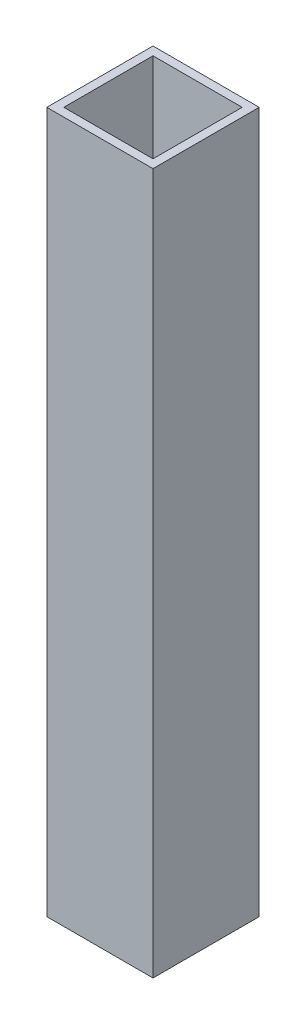
ISO-10303-21;
HEADER;
FILE_DESCRIPTION(('STEP AP214'),'2;1');
FILE_NAME('part.step','',(''),(''),'','','');
FILE_SCHEMA(('AUTOMOTIVE_DESIGN { 1 0 10303 214 1 1 1 1 }'));
ENDSEC;
DATA;
#1=APPLICATION_CONTEXT('core data for automotive mechanical design processes');
#2=APPLICATION_PROTOCOL_DEFINITION('international standard','automotive_design',2000,#1);
#3=PRODUCT_CONTEXT('',#1,'mechanical');
#4=PRODUCT('Part','Part','',(#3));
#5=PRODUCT_RELATED_PRODUCT_CATEGORY('part','',(#4));
#6=PRODUCT_DEFINITION_FORMATION('','',#4);
#7=PRODUCT_DEFINITION_CONTEXT('part definition',#1,'design');
#8=PRODUCT_DEFINITION('design','',#6,#7);
#9=PRODUCT_DEFINITION_SHAPE('','',#8);
#10=(LENGTH_UNIT() NAMED_UNIT(*) SI_UNIT(.MILLI.,.METRE.));
#11=(NAMED_UNIT(*) PLANE_ANGLE_UNIT() SI_UNIT($,.RADIAN.));
#12=(NAMED_UNIT(*) SI_UNIT($,.STERADIAN.) SOLID_ANGLE_UNIT());
#13=UNCERTAINTY_MEASURE_WITH_UNIT(LENGTH_MEASURE(1.E-05),#10,'distance_accuracy_value','');
#14=(GEOMETRIC_REPRESENTATION_CONTEXT(3) GLOBAL_UNCERTAINTY_ASSIGNED_CONTEXT((#13)) GLOBAL_UNIT_ASSIGNED_CONTEXT((#10,
#11,#12)) REPRESENTATION_CONTEXT('',''));
#15=CARTESIAN_POINT('',(0.,0.,0.));
#16=DIRECTION('',(0.,0.,1.));
#17=DIRECTION('',(1.,0.,0.));
#18=AXIS2_PLACEMENT_3D('',#15,#16,#17);
#19=CARTESIAN_POINT('',(0.,165.,0.));
#20=DIRECTION('',(0.,1.,0.));
#21=DIRECTION('',(0.,0.,1.));
#22=AXIS2_PLACEMENT_3D('',#19,#20,#21);
#23=PLANE('',#22);
#24=DIRECTION('',(0.,0.,1.));
#25=VECTOR('',#24,1.);
#26=CARTESIAN_POINT('',(-12.5,165.,-12.5));
#27=LINE('',#26,#25);
#28=CARTESIAN_POINT('',(-12.5,165.,-12.5));
#29=VERTEX_POINT('',#28);
#30=CARTESIAN_POINT('',(-12.5,165.,12.5));
#31=VERTEX_POINT('',#30);
#32=EDGE_CURVE('E134',#29,#31,#27,.T.);
#33=ORIENTED_EDGE('',*,*,#32,.T.);
#34=DIRECTION('',(1.,0.,0.));
#35=VECTOR('',#34,1.);
#36=CARTESIAN_POINT('',(-12.5,165.,12.5));
#37=LINE('',#36,#35);
#38=CARTESIAN_POINT('',(12.5,165.,12.5));
#39=VERTEX_POINT('',#38);
#40=EDGE_CURVE('E137',#31,#39,#37,.T.);
#41=ORIENTED_EDGE('',*,*,#40,.T.);
#42=DIRECTION('',(0.,0.,-1.));
#43=VECTOR('',#42,1.);
#44=CARTESIAN_POINT('',(12.5,165.,-12.5));
#45=LINE('',#44,#43);
#46=CARTESIAN_POINT('',(12.5,165.,-12.5));
#47=VERTEX_POINT('',#46);
#48=EDGE_CURVE('E140',#39,#47,#45,.T.);
#49=ORIENTED_EDGE('',*,*,#48,.T.);
#50=DIRECTION('',(-1.,0.,0.));
#51=VECTOR('',#50,1.);
#52=CARTESIAN_POINT('',(-12.5,165.,-12.5));
#53=LINE('',#52,#51);
#54=EDGE_CURVE('E142',#47,#29,#53,.T.);
#55=ORIENTED_EDGE('',*,*,#54,.T.);
#56=EDGE_LOOP('',(#33,#41,#49,#55));
#57=FACE_BOUND('',#56,.T.);
#58=DIRECTION('',(1.,0.,0.));
#59=VECTOR('',#58,1.);
#60=CARTESIAN_POINT('',(-10.5,165.,10.5));
#61=LINE('',#60,#59);
#62=CARTESIAN_POINT('',(-10.5,165.,10.5));
#63=VERTEX_POINT('',#62);
#64=CARTESIAN_POINT('',(10.5,165.,10.5));
#65=VERTEX_POINT('',#64);
#66=EDGE_CURVE('E106',#63,#65,#61,.T.);
#67=ORIENTED_EDGE('',*,*,#66,.F.);
#68=DIRECTION('',(0.,0.,1.));
#69=VECTOR('',#68,1.);
#70=CARTESIAN_POINT('',(-10.5,165.,-10.5));
#71=LINE('',#70,#69);
#72=CARTESIAN_POINT('',(-10.5,165.,-10.5));
#73=VERTEX_POINT('',#72);
#74=EDGE_CURVE('E98',#73,#63,#71,.T.);
#75=ORIENTED_EDGE('',*,*,#74,.F.);
#76=DIRECTION('',(-1.,0.,0.));
#77=VECTOR('',#76,1.);
#78=CARTESIAN_POINT('',(-10.5,165.,-10.5));
#79=LINE('',#78,#77);
#80=CARTESIAN_POINT('',(10.5,165.,-10.5));
#81=VERTEX_POINT('',#80);
#82=EDGE_CURVE('E120',#81,#73,#79,.T.);
#83=ORIENTED_EDGE('',*,*,#82,.F.);
#84=DIRECTION('',(0.,0.,-1.));
#85=VECTOR('',#84,1.);
#86=CARTESIAN_POINT('',(10.5,165.,-10.5));
#87=LINE('',#86,#85);
#88=EDGE_CURVE('E118',#65,#81,#87,.T.);
#89=ORIENTED_EDGE('',*,*,#88,.F.);
#90=EDGE_LOOP('',(#67,#75,#83,#89));
#91=FACE_BOUND('',#90,.T.);
#92=ADVANCED_FACE('F33',(#57,#91),#23,.T.);
#93=CARTESIAN_POINT('',(0.,0.,0.));
#94=DIRECTION('',(0.,1.,0.));
#95=DIRECTION('',(0.,0.,1.));
#96=AXIS2_PLACEMENT_3D('',#93,#94,#95);
#97=PLANE('',#96);
#98=DIRECTION('',(0.,0.,1.));
#99=VECTOR('',#98,1.);
#100=CARTESIAN_POINT('',(-12.5,0.,-12.5));
#101=LINE('',#100,#99);
#102=CARTESIAN_POINT('',(-12.5,0.,-12.5));
#103=VERTEX_POINT('',#102);
#104=CARTESIAN_POINT('',(-12.5,0.,12.5));
#105=VERTEX_POINT('',#104);
#106=EDGE_CURVE('E114',#103,#105,#101,.T.);
#107=ORIENTED_EDGE('',*,*,#106,.F.);
#108=DIRECTION('',(-1.,0.,0.));
#109=VECTOR('',#108,1.);
#110=CARTESIAN_POINT('',(-12.5,0.,-12.5));
#111=LINE('',#110,#109);
#112=CARTESIAN_POINT('',(12.5,0.,-12.5));
#113=VERTEX_POINT('',#112);
#114=EDGE_CURVE('E138',#113,#103,#111,.T.);
#115=ORIENTED_EDGE('',*,*,#114,.F.);
#116=DIRECTION('',(0.,0.,-1.));
#117=VECTOR('',#116,1.);
#118=CARTESIAN_POINT('',(12.5,0.,-12.5));
#119=LINE('',#118,#117);
#120=CARTESIAN_POINT('',(12.5,0.,12.5));
#121=VERTEX_POINT('',#120);
#122=EDGE_CURVE('E149',#121,#113,#119,.T.);
#123=ORIENTED_EDGE('',*,*,#122,.F.);
#124=DIRECTION('',(1.,0.,0.));
#125=VECTOR('',#124,1.);
#126=CARTESIAN_POINT('',(-12.5,0.,12.5));
#127=LINE('',#126,#125);
#128=EDGE_CURVE('E147',#105,#121,#127,.T.);
#129=ORIENTED_EDGE('',*,*,#128,.F.);
#130=EDGE_LOOP('',(#107,#115,#123,#129));
#131=FACE_BOUND('',#130,.T.);
#132=DIRECTION('',(0.,0.,1.));
#133=VECTOR('',#132,1.);
#134=CARTESIAN_POINT('',(-10.5,0.,-10.5));
#135=LINE('',#134,#133);
#136=CARTESIAN_POINT('',(-10.5,0.,-10.5));
#137=VERTEX_POINT('',#136);
#138=CARTESIAN_POINT('',(-10.5,0.,10.5));
#139=VERTEX_POINT('',#138);
#140=EDGE_CURVE('E56',#137,#139,#135,.T.);
#141=ORIENTED_EDGE('',*,*,#140,.T.);
#142=DIRECTION('',(1.,0.,0.));
#143=VECTOR('',#142,1.);
#144=CARTESIAN_POINT('',(-10.5,0.,10.5));
#145=LINE('',#144,#143);
#146=CARTESIAN_POINT('',(10.5,0.,10.5));
#147=VERTEX_POINT('',#146);
#148=EDGE_CURVE('E113',#139,#147,#145,.T.);
#149=ORIENTED_EDGE('',*,*,#148,.T.);
#150=DIRECTION('',(0.,0.,-1.));
#151=VECTOR('',#150,1.);
#152=CARTESIAN_POINT('',(10.5,0.,-10.5));
#153=LINE('',#152,#151);
#154=CARTESIAN_POINT('',(10.5,0.,-10.5));
#155=VERTEX_POINT('',#154);
#156=EDGE_CURVE('E126',#147,#155,#153,.T.);
#157=ORIENTED_EDGE('',*,*,#156,.T.);
#158=DIRECTION('',(-1.,0.,0.));
#159=VECTOR('',#158,1.);
#160=CARTESIAN_POINT('',(-10.5,0.,-10.5));
#161=LINE('',#160,#159);
#162=EDGE_CURVE('E107',#155,#137,#161,.T.);
#163=ORIENTED_EDGE('',*,*,#162,.T.);
#164=EDGE_LOOP('',(#141,#149,#157,#163));
#165=FACE_BOUND('',#164,.T.);
#166=ADVANCED_FACE('F167',(#131,#165),#97,.F.);
#167=CARTESIAN_POINT('',(-12.5,165.,-12.5));
#168=DIRECTION('',(1.,0.,0.));
#169=DIRECTION('',(0.,0.,-1.));
#170=AXIS2_PLACEMENT_3D('',#167,#168,#169);
#171=PLANE('',#170);
#172=ORIENTED_EDGE('',*,*,#106,.T.);
#173=DIRECTION('',(0.,-1.,0.));
#174=VECTOR('',#173,1.);
#175=CARTESIAN_POINT('',(-12.5,165.,12.5));
#176=LINE('',#175,#174);
#177=EDGE_CURVE('E11',#31,#105,#176,.T.);
#178=ORIENTED_EDGE('',*,*,#177,.F.);
#179=ORIENTED_EDGE('',*,*,#32,.F.);
#180=DIRECTION('',(0.,-1.,0.));
#181=VECTOR('',#180,1.);
#182=CARTESIAN_POINT('',(-12.5,165.,-12.5));
#183=LINE('',#182,#181);
#184=EDGE_CURVE('E144',#29,#103,#183,.T.);
#185=ORIENTED_EDGE('',*,*,#184,.T.);
#186=EDGE_LOOP('',(#172,#178,#179,#185));
#187=FACE_BOUND('',#186,.T.);
#188=ADVANCED_FACE('F35',(#187),#171,.F.);
#189=CARTESIAN_POINT('',(-12.5,165.,12.5));
#190=DIRECTION('',(0.,0.,-1.));
#191=DIRECTION('',(-1.,0.,0.));
#192=AXIS2_PLACEMENT_3D('',#189,#190,#191);
#193=PLANE('',#192);
#194=ORIENTED_EDGE('',*,*,#128,.T.);
#195=DIRECTION('',(0.,-1.,0.));
#196=VECTOR('',#195,1.);
#197=CARTESIAN_POINT('',(12.5,165.,12.5));
#198=LINE('',#197,#196);
#199=EDGE_CURVE('E41',#39,#121,#198,.T.);
#200=ORIENTED_EDGE('',*,*,#199,.F.);
#201=ORIENTED_EDGE('',*,*,#40,.F.);
#202=ORIENTED_EDGE('',*,*,#177,.T.);
#203=EDGE_LOOP('',(#194,#200,#201,#202));
#204=FACE_BOUND('',#203,.T.);
#205=ADVANCED_FACE('F177',(#204),#193,.F.);
#206=CARTESIAN_POINT('',(12.5,165.,-12.5));
#207=DIRECTION('',(-1.,0.,0.));
#208=DIRECTION('',(0.,0.,1.));
#209=AXIS2_PLACEMENT_3D('',#206,#207,#208);
#210=PLANE('',#209);
#211=ORIENTED_EDGE('',*,*,#122,.T.);
#212=DIRECTION('',(0.,-1.,0.));
#213=VECTOR('',#212,1.);
#214=CARTESIAN_POINT('',(12.5,165.,-12.5));
#215=LINE('',#214,#213);
#216=EDGE_CURVE('E154',#47,#113,#215,.T.);
#217=ORIENTED_EDGE('',*,*,#216,.F.);
#218=ORIENTED_EDGE('',*,*,#48,.F.);
#219=ORIENTED_EDGE('',*,*,#199,.T.);
#220=EDGE_LOOP('',(#211,#217,#218,#219));
#221=FACE_BOUND('',#220,.T.);
#222=ADVANCED_FACE('F161',(#221),#210,.F.);
#223=CARTESIAN_POINT('',(-12.5,165.,-12.5));
#224=DIRECTION('',(0.,0.,1.));
#225=DIRECTION('',(1.,0.,0.));
#226=AXIS2_PLACEMENT_3D('',#223,#224,#225);
#227=PLANE('',#226);
#228=ORIENTED_EDGE('',*,*,#114,.T.);
#229=ORIENTED_EDGE('',*,*,#184,.F.);
#230=ORIENTED_EDGE('',*,*,#54,.F.);
#231=ORIENTED_EDGE('',*,*,#216,.T.);
#232=EDGE_LOOP('',(#228,#229,#230,#231));
#233=FACE_BOUND('',#232,.T.);
#234=ADVANCED_FACE('F171',(#233),#227,.F.);
#235=CARTESIAN_POINT('',(-10.5,165.,-10.5));
#236=DIRECTION('',(1.,0.,0.));
#237=DIRECTION('',(0.,0.,-1.));
#238=AXIS2_PLACEMENT_3D('',#235,#236,#237);
#239=PLANE('',#238);
#240=ORIENTED_EDGE('',*,*,#140,.F.);
#241=DIRECTION('',(0.,-1.,0.));
#242=VECTOR('',#241,1.);
#243=CARTESIAN_POINT('',(-10.5,165.,-10.5));
#244=LINE('',#243,#242);
#245=EDGE_CURVE('E102',#73,#137,#244,.T.);
#246=ORIENTED_EDGE('',*,*,#245,.F.);
#247=ORIENTED_EDGE('',*,*,#74,.T.);
#248=DIRECTION('',(0.,-1.,0.));
#249=VECTOR('',#248,1.);
#250=CARTESIAN_POINT('',(-10.5,165.,10.5));
#251=LINE('',#250,#249);
#252=EDGE_CURVE('E101',#63,#139,#251,.T.);
#253=ORIENTED_EDGE('',*,*,#252,.T.);
#254=EDGE_LOOP('',(#240,#246,#247,#253));
#255=FACE_BOUND('',#254,.T.);
#256=ADVANCED_FACE('F100',(#255),#239,.T.);
#257=CARTESIAN_POINT('',(-10.5,165.,10.5));
#258=DIRECTION('',(0.,0.,-1.));
#259=DIRECTION('',(-1.,0.,0.));
#260=AXIS2_PLACEMENT_3D('',#257,#258,#259);
#261=PLANE('',#260);
#262=ORIENTED_EDGE('',*,*,#148,.F.);
#263=ORIENTED_EDGE('',*,*,#252,.F.);
#264=ORIENTED_EDGE('',*,*,#66,.T.);
#265=DIRECTION('',(0.,-1.,0.));
#266=VECTOR('',#265,1.);
#267=CARTESIAN_POINT('',(10.5,165.,10.5));
#268=LINE('',#267,#266);
#269=EDGE_CURVE('E115',#65,#147,#268,.T.);
#270=ORIENTED_EDGE('',*,*,#269,.T.);
#271=EDGE_LOOP('',(#262,#263,#264,#270));
#272=FACE_BOUND('',#271,.T.);
#273=ADVANCED_FACE('F110',(#272),#261,.T.);
#274=CARTESIAN_POINT('',(10.5,165.,-10.5));
#275=DIRECTION('',(-1.,0.,0.));
#276=DIRECTION('',(0.,0.,1.));
#277=AXIS2_PLACEMENT_3D('',#274,#275,#276);
#278=PLANE('',#277);
#279=ORIENTED_EDGE('',*,*,#156,.F.);
#280=ORIENTED_EDGE('',*,*,#269,.F.);
#281=ORIENTED_EDGE('',*,*,#88,.T.);
#282=DIRECTION('',(0.,-1.,0.));
#283=VECTOR('',#282,1.);
#284=CARTESIAN_POINT('',(10.5,165.,-10.5));
#285=LINE('',#284,#283);
#286=EDGE_CURVE('E48',#81,#155,#285,.T.);
#287=ORIENTED_EDGE('',*,*,#286,.T.);
#288=EDGE_LOOP('',(#279,#280,#281,#287));
#289=FACE_BOUND('',#288,.T.);
#290=ADVANCED_FACE('F200',(#289),#278,.T.);
#291=CARTESIAN_POINT('',(-10.5,165.,-10.5));
#292=DIRECTION('',(0.,0.,1.));
#293=DIRECTION('',(1.,0.,0.));
#294=AXIS2_PLACEMENT_3D('',#291,#292,#293);
#295=PLANE('',#294);
#296=ORIENTED_EDGE('',*,*,#162,.F.);
#297=ORIENTED_EDGE('',*,*,#286,.F.);
#298=ORIENTED_EDGE('',*,*,#82,.T.);
#299=ORIENTED_EDGE('',*,*,#245,.T.);
#300=EDGE_LOOP('',(#296,#297,#298,#299));
#301=FACE_BOUND('',#300,.T.);
#302=ADVANCED_FACE('F204',(#301),#295,.T.);
#303=CLOSED_SHELL('',(#92,#166,#188,#205,#222,#234,#256,#273,#290,#302));
#304=MANIFOLD_SOLID_BREP('B2',#303);
#305=ADVANCED_BREP_SHAPE_REPRESENTATION('',(#18,#304),#14);
#306=SHAPE_DEFINITION_REPRESENTATION(#9,#305);
ENDSEC;
END-ISO-10303-21;
